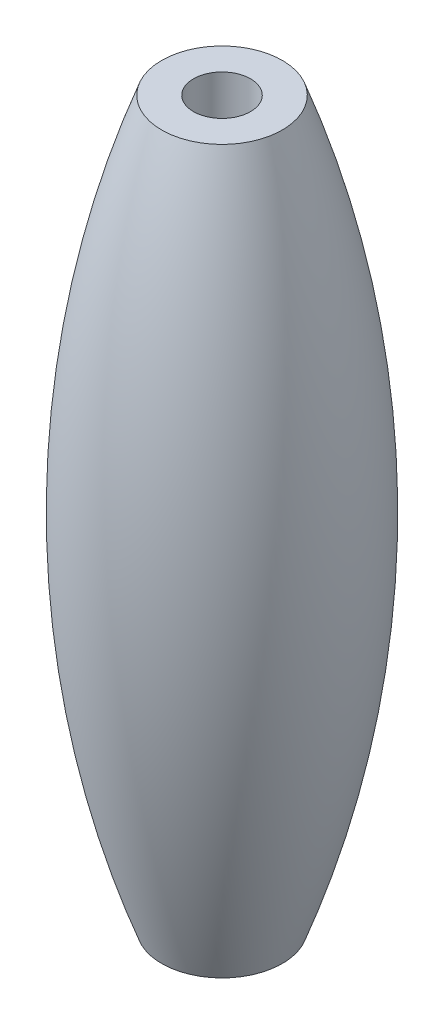
ISO-10303-21;
HEADER;
FILE_DESCRIPTION(('STEP AP214'),'2;1');
FILE_NAME('part.step','',(''),(''),'','','');
FILE_SCHEMA(('AUTOMOTIVE_DESIGN { 1 0 10303 214 1 1 1 1 }'));
ENDSEC;
DATA;
#1=APPLICATION_CONTEXT('core data for automotive mechanical design processes');
#2=APPLICATION_PROTOCOL_DEFINITION('international standard','automotive_design',2000,#1);
#3=PRODUCT_CONTEXT('',#1,'mechanical');
#4=PRODUCT('Part','Part','',(#3));
#5=PRODUCT_RELATED_PRODUCT_CATEGORY('part','',(#4));
#6=PRODUCT_DEFINITION_FORMATION('','',#4);
#7=PRODUCT_DEFINITION_CONTEXT('part definition',#1,'design');
#8=PRODUCT_DEFINITION('design','',#6,#7);
#9=PRODUCT_DEFINITION_SHAPE('','',#8);
#10=(LENGTH_UNIT() NAMED_UNIT(*) SI_UNIT(.MILLI.,.METRE.));
#11=(NAMED_UNIT(*) PLANE_ANGLE_UNIT() SI_UNIT($,.RADIAN.));
#12=(NAMED_UNIT(*) SI_UNIT($,.STERADIAN.) SOLID_ANGLE_UNIT());
#13=UNCERTAINTY_MEASURE_WITH_UNIT(LENGTH_MEASURE(1.E-05),#10,'distance_accuracy_value','');
#14=(GEOMETRIC_REPRESENTATION_CONTEXT(3) GLOBAL_UNCERTAINTY_ASSIGNED_CONTEXT((#13)) GLOBAL_UNIT_ASSIGNED_CONTEXT((#10,
#11,#12)) REPRESENTATION_CONTEXT('',''));
#15=CARTESIAN_POINT('',(0.,0.,0.));
#16=DIRECTION('',(0.,0.,1.));
#17=DIRECTION('',(1.,0.,0.));
#18=AXIS2_PLACEMENT_3D('',#15,#16,#17);
#19=CARTESIAN_POINT('',(0.,17.8713013575045,0.));
#20=DIRECTION('',(0.,-1.,0.));
#21=DIRECTION('',(1.,0.,0.));
#22=AXIS2_PLACEMENT_3D('',#19,#20,#21);
#23=PLANE('',#22);
#24=CARTESIAN_POINT('',(0.,17.8713013575045,0.));
#25=DIRECTION('',(0.,1.,0.));
#26=DIRECTION('',(0.,0.,1.));
#27=AXIS2_PLACEMENT_3D('',#24,#25,#26);
#28=CIRCLE('',#27,1.5);
#29=CARTESIAN_POINT('',(0.,17.8713013575045,1.5));
#30=VERTEX_POINT('',#29);
#31=EDGE_CURVE('E54',#30,#30,#28,.T.);
#32=ORIENTED_EDGE('',*,*,#31,.F.);
#33=EDGE_LOOP('',(#32));
#34=FACE_BOUND('',#33,.T.);
#35=CARTESIAN_POINT('',(0.,17.8713013575045,0.));
#36=DIRECTION('',(0.,1.,0.));
#37=DIRECTION('',(-1.,0.,0.));
#38=AXIS2_PLACEMENT_3D('',#35,#36,#37);
#39=CIRCLE('',#38,3.175);
#40=CARTESIAN_POINT('',(-3.175,17.8713013575045,0.));
#41=VERTEX_POINT('',#40);
#42=EDGE_CURVE('E10',#41,#41,#39,.T.);
#43=ORIENTED_EDGE('',*,*,#42,.T.);
#44=EDGE_LOOP('',(#43));
#45=FACE_BOUND('',#44,.T.);
#46=ADVANCED_FACE('F37',(#34,#45),#23,.F.);
#47=CARTESIAN_POINT('',(0.,-1.12869864249552,0.));
#48=DIRECTION('',(0.,1.,0.));
#49=DIRECTION('',(-1.,0.,0.));
#50=AXIS2_PLACEMENT_3D('',#47,#48,#49);
#51=DEGENERATE_TOROIDAL_SURFACE('',#50,48.7810295106277,55.3211442624718,.F.);
#52=ORIENTED_EDGE('',*,*,#42,.F.);
#53=EDGE_LOOP('',(#52));
#54=FACE_BOUND('',#53,.T.);
#55=CARTESIAN_POINT('',(0.,-20.1286986424955,0.));
#56=DIRECTION('',(0.,1.,0.));
#57=DIRECTION('',(-1.,0.,0.));
#58=AXIS2_PLACEMENT_3D('',#55,#56,#57);
#59=CIRCLE('',#58,3.175);
#60=CARTESIAN_POINT('',(-3.175,-20.1286986424955,0.));
#61=VERTEX_POINT('',#60);
#62=EDGE_CURVE('E44',#61,#61,#59,.T.);
#63=ORIENTED_EDGE('',*,*,#62,.T.);
#64=EDGE_LOOP('',(#63));
#65=FACE_BOUND('',#64,.T.);
#66=ADVANCED_FACE('F64',(#54,#65),#51,.F.);
#67=CARTESIAN_POINT('',(0.,-20.1286986424955,0.));
#68=DIRECTION('',(0.,1.,0.));
#69=DIRECTION('',(-1.,0.,0.));
#70=AXIS2_PLACEMENT_3D('',#67,#68,#69);
#71=PLANE('',#70);
#72=CARTESIAN_POINT('',(0.,-20.1286986424955,0.));
#73=DIRECTION('',(0.,1.,0.));
#74=DIRECTION('',(0.,0.,1.));
#75=AXIS2_PLACEMENT_3D('',#72,#73,#74);
#76=CIRCLE('',#75,1.5);
#77=CARTESIAN_POINT('',(0.,-20.1286986424955,1.5));
#78=VERTEX_POINT('',#77);
#79=EDGE_CURVE('E49',#78,#78,#76,.T.);
#80=ORIENTED_EDGE('',*,*,#79,.T.);
#81=EDGE_LOOP('',(#80));
#82=FACE_BOUND('',#81,.T.);
#83=ORIENTED_EDGE('',*,*,#62,.F.);
#84=EDGE_LOOP('',(#83));
#85=FACE_BOUND('',#84,.T.);
#86=ADVANCED_FACE('F68',(#82,#85),#71,.F.);
#87=CARTESIAN_POINT('',(0.,17.8713013575045,0.));
#88=DIRECTION('',(0.,1.,0.));
#89=DIRECTION('',(0.,0.,1.));
#90=AXIS2_PLACEMENT_3D('',#87,#88,#89);
#91=CYLINDRICAL_SURFACE('',#90,1.5);
#92=ORIENTED_EDGE('',*,*,#79,.F.);
#93=EDGE_LOOP('',(#92));
#94=FACE_BOUND('',#93,.T.);
#95=ORIENTED_EDGE('',*,*,#31,.T.);
#96=EDGE_LOOP('',(#95));
#97=FACE_BOUND('',#96,.T.);
#98=ADVANCED_FACE('F61',(#94,#97),#91,.F.);
#99=CLOSED_SHELL('',(#46,#66,#86,#98));
#100=MANIFOLD_SOLID_BREP('B2',#99);
#101=ADVANCED_BREP_SHAPE_REPRESENTATION('',(#18,#100),#14);
#102=SHAPE_DEFINITION_REPRESENTATION(#9,#101);
ENDSEC;
END-ISO-10303-21;
